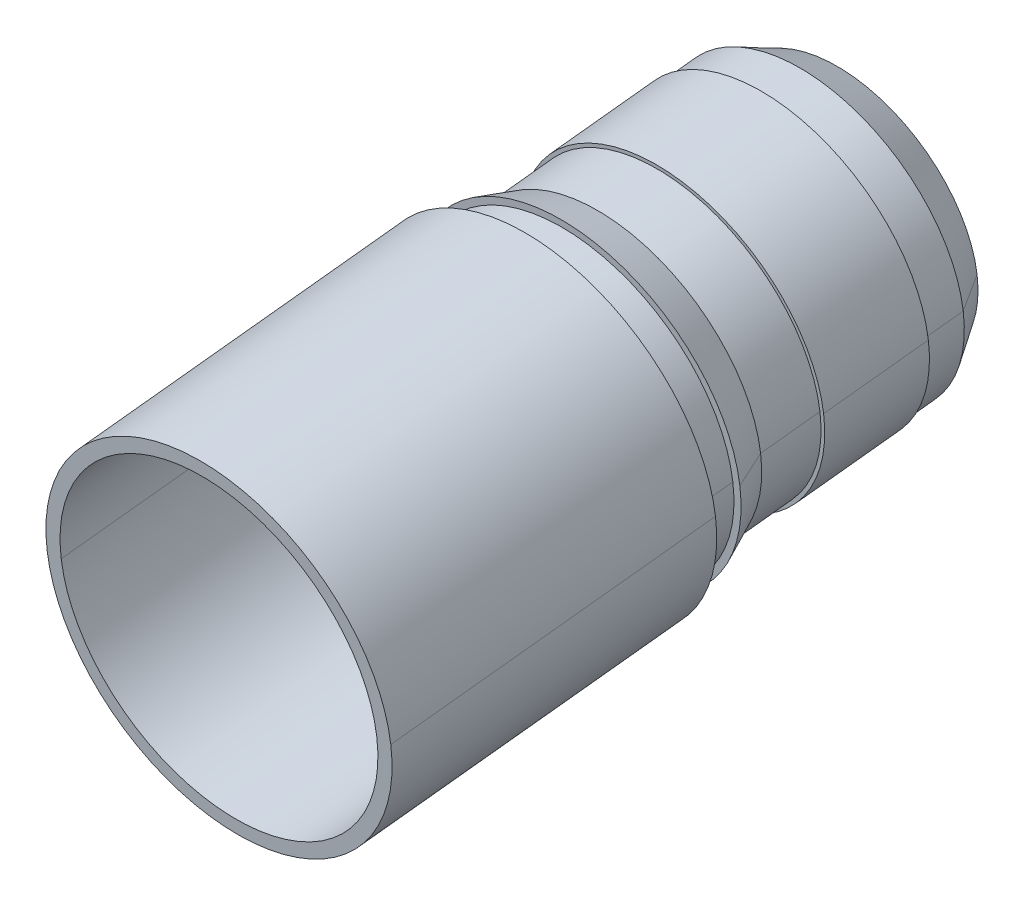
ISO-10303-21;
HEADER;
FILE_DESCRIPTION(('STEP AP214'),'2;1');
FILE_NAME('part.step','',(''),(''),'','','');
FILE_SCHEMA(('AUTOMOTIVE_DESIGN { 1 0 10303 214 1 1 1 1 }'));
ENDSEC;
DATA;
#1=APPLICATION_CONTEXT('core data for automotive mechanical design processes');
#2=APPLICATION_PROTOCOL_DEFINITION('international standard','automotive_design',2000,#1);
#3=PRODUCT_CONTEXT('',#1,'mechanical');
#4=PRODUCT('Part','Part','',(#3));
#5=PRODUCT_RELATED_PRODUCT_CATEGORY('part','',(#4));
#6=PRODUCT_DEFINITION_FORMATION('','',#4);
#7=PRODUCT_DEFINITION_CONTEXT('part definition',#1,'design');
#8=PRODUCT_DEFINITION('design','',#6,#7);
#9=PRODUCT_DEFINITION_SHAPE('','',#8);
#10=(LENGTH_UNIT() NAMED_UNIT(*) SI_UNIT(.MILLI.,.METRE.));
#11=(NAMED_UNIT(*) PLANE_ANGLE_UNIT() SI_UNIT($,.RADIAN.));
#12=(NAMED_UNIT(*) SI_UNIT($,.STERADIAN.) SOLID_ANGLE_UNIT());
#13=UNCERTAINTY_MEASURE_WITH_UNIT(LENGTH_MEASURE(1.E-05),#10,'distance_accuracy_value','');
#14=(GEOMETRIC_REPRESENTATION_CONTEXT(3) GLOBAL_UNCERTAINTY_ASSIGNED_CONTEXT((#13)) GLOBAL_UNIT_ASSIGNED_CONTEXT((#10,
#11,#12)) REPRESENTATION_CONTEXT('',''));
#15=CARTESIAN_POINT('',(0.,0.,0.));
#16=DIRECTION('',(0.,0.,1.));
#17=DIRECTION('',(1.,0.,0.));
#18=AXIS2_PLACEMENT_3D('',#15,#16,#17);
#19=CARTESIAN_POINT('',(14.5150151432412,132.941967215606,-6.97974796869001));
#20=DIRECTION('',(0.,-0.10808816258182,0.994141312444909));
#21=DIRECTION('',(-0.999908693388716,-0.0134339682706832,-0.0014606102053832));
#22=AXIS2_PLACEMENT_3D('',#19,#20,#21);
#23=CONICAL_SURFACE('',#22,5.78569961957873,0.541052068118243);
#24=CARTESIAN_POINT('',(14.5150151432412,133.137501170985,-8.77817231400749));
#25=DIRECTION('',(0.,0.10808816258182,-0.994141312444909));
#26=DIRECTION('',(-0.999908693388716,-0.0134339682706826,-0.00146061020538331));
#27=AXIS2_PLACEMENT_3D('',#24,#25,#26);
#28=CIRCLE('',#27,4.69872903312946);
#29=CARTESIAN_POINT('',(9.81671513513707,133.074378594241,-8.78503532558561));
#30=VERTEX_POINT('',#29);
#31=CARTESIAN_POINT('',(19.2133151513452,133.200623747729,-8.77130930242936));
#32=VERTEX_POINT('',#31);
#33=EDGE_CURVE('E13',#30,#32,#28,.T.);
#34=ORIENTED_EDGE('',*,*,#33,.T.);
#35=DIRECTION('',(0.514991048528762,-0.0857306334015749,0.852897695173232));
#36=VECTOR('',#35,1.);
#37=CARTESIAN_POINT('',(20.3001864901938,133.019692120719,-6.97129731678037));
#38=LINE('',#37,#36);
#39=CARTESIAN_POINT('',(20.2144946955569,133.033957246011,-7.11321499544652));
#40=VERTEX_POINT('',#39);
#41=EDGE_CURVE('E36',#32,#40,#38,.T.);
#42=ORIENTED_EDGE('',*,*,#41,.T.);
#43=CARTESIAN_POINT('',(14.5150151432412,132.957383626868,-7.12154047361721));
#44=DIRECTION('',(0.,0.10808816258182,-0.994141312444909));
#45=DIRECTION('',(0.999908693388717,0.0134339682706793,0.00146061020538294));
#46=AXIS2_PLACEMENT_3D('',#43,#44,#45);
#47=CIRCLE('',#46,5.7);
#48=CARTESIAN_POINT('',(8.8155355909255,132.880810007726,-7.1298659517879));
#49=VERTEX_POINT('',#48);
#50=EDGE_CURVE('E287',#49,#40,#47,.T.);
#51=ORIENTED_EDGE('',*,*,#50,.F.);
#52=DIRECTION('',(-0.514991048528744,-0.0995686437146445,0.851393155436483));
#53=VECTOR('',#52,1.);
#54=CARTESIAN_POINT('',(8.72984379628862,132.864242310493,-6.98819862059964));
#55=LINE('',#54,#53);
#56=EDGE_CURVE('E395',#30,#49,#55,.T.);
#57=ORIENTED_EDGE('',*,*,#56,.F.);
#58=EDGE_LOOP('',(#34,#42,#51,#57));
#59=FACE_BOUND('',#58,.T.);
#60=ADVANCED_FACE('F25',(#59),#23,.F.);
#61=CARTESIAN_POINT('',(14.5150151432412,132.975368927112,-7.28696034534012));
#62=DIRECTION('',(0.,-0.10808816258182,0.994141312444909));
#63=DIRECTION('',(0.999908693388716,0.0134339682706842,0.00146061020538324));
#64=AXIS2_PLACEMENT_3D('',#61,#62,#63);
#65=CYLINDRICAL_SURFACE('',#64,5.7);
#66=CARTESIAN_POINT('',(14.5150151432412,132.957383626868,-7.12154047361721));
#67=DIRECTION('',(0.,0.10808816258182,-0.994141312444909));
#68=DIRECTION('',(0.999908693388717,0.0134339682706793,0.00146061020538294));
#69=AXIS2_PLACEMENT_3D('',#66,#67,#68);
#70=CIRCLE('',#69,5.7);
#71=EDGE_CURVE('E372',#40,#49,#70,.T.);
#72=ORIENTED_EDGE('',*,*,#71,.T.);
#73=DIRECTION('',(0.,-0.10808816258182,0.994141312444909));
#74=VECTOR('',#73,1.);
#75=CARTESIAN_POINT('',(8.8155355909255,132.898795307969,-7.2952858235108));
#76=LINE('',#75,#74);
#77=CARTESIAN_POINT('',(8.81553559092552,132.65559694216,-5.05846787050975));
#78=VERTEX_POINT('',#77);
#79=EDGE_CURVE('E389',#49,#78,#76,.T.);
#80=ORIENTED_EDGE('',*,*,#79,.T.);
#81=CARTESIAN_POINT('',(14.5150151432412,132.732170561303,-5.05014239233907));
#82=DIRECTION('',(0.,0.10808816258182,-0.994141312444909));
#83=DIRECTION('',(-0.999908693388716,-0.0134339682706842,-0.00146061020538324));
#84=AXIS2_PLACEMENT_3D('',#81,#82,#83);
#85=CIRCLE('',#84,5.7);
#86=CARTESIAN_POINT('',(20.2144946955569,132.808744180446,-5.04181691416838));
#87=VERTEX_POINT('',#86);
#88=EDGE_CURVE('E353',#87,#78,#85,.T.);
#89=ORIENTED_EDGE('',*,*,#88,.F.);
#90=DIRECTION('',(0.,-0.10808816258182,0.994141312444909));
#91=VECTOR('',#90,1.);
#92=CARTESIAN_POINT('',(20.2144946955569,133.051942546255,-7.27863486716943));
#93=LINE('',#92,#91);
#94=EDGE_CURVE('E284',#40,#87,#93,.T.);
#95=ORIENTED_EDGE('',*,*,#94,.F.);
#96=EDGE_LOOP('',(#72,#80,#89,#95));
#97=FACE_BOUND('',#96,.T.);
#98=ADVANCED_FACE('F693',(#97),#65,.F.);
#99=CARTESIAN_POINT('',(14.5150151432412,132.797023458852,-5.64662717980602));
#100=DIRECTION('',(0.,-0.10808816258182,0.994141312444909));
#101=DIRECTION('',(0.999908693388716,0.0134339682706816,0.00146061020538321));
#102=AXIS2_PLACEMENT_3D('',#99,#100,#101);
#103=CYLINDRICAL_SURFACE('',#102,5.85);
#104=CARTESIAN_POINT('',(14.5150151432412,132.732170561303,-5.05014239233907));
#105=DIRECTION('',(0.,0.10808816258182,-0.994141312444909));
#106=DIRECTION('',(-0.999908693388716,-0.0134339682706816,-0.00146061020538321));
#107=AXIS2_PLACEMENT_3D('',#104,#105,#106);
#108=CIRCLE('',#107,5.85);
#109=CARTESIAN_POINT('',(20.3644809995652,132.810759275687,-5.04159782263758));
#110=VERTEX_POINT('',#109);
#111=CARTESIAN_POINT('',(8.66554928691722,132.65358184692,-5.05868696204056));
#112=VERTEX_POINT('',#111);
#113=EDGE_CURVE('E385',#110,#112,#108,.T.);
#114=ORIENTED_EDGE('',*,*,#113,.T.);
#115=DIRECTION('',(0.,-0.10808816258182,0.994141312444909));
#116=VECTOR('',#115,1.);
#117=CARTESIAN_POINT('',(8.66554928691721,132.718434744469,-5.65517174950751));
#118=LINE('',#117,#116);
#119=CARTESIAN_POINT('',(8.66554928691726,132.2968909104,-1.77802063097235));
#120=VERTEX_POINT('',#119);
#121=EDGE_CURVE('E390',#112,#120,#118,.T.);
#122=ORIENTED_EDGE('',*,*,#121,.T.);
#123=CARTESIAN_POINT('',(14.5150151432412,132.375479624783,-1.76947606127086));
#124=DIRECTION('',(0.,0.10808816258182,-0.994141312444909));
#125=DIRECTION('',(-0.999908693388716,-0.0134339682706816,-0.00146061020538321));
#126=AXIS2_PLACEMENT_3D('',#123,#124,#125);
#127=CIRCLE('',#126,5.85);
#128=CARTESIAN_POINT('',(20.3644809995653,132.454068339167,-1.76093149156938));
#129=VERTEX_POINT('',#128);
#130=EDGE_CURVE('E426',#129,#120,#127,.T.);
#131=ORIENTED_EDGE('',*,*,#130,.F.);
#132=DIRECTION('',(0.,-0.10808816258182,0.994141312444909));
#133=VECTOR('',#132,1.);
#134=CARTESIAN_POINT('',(20.3644809995652,132.875612173236,-5.63808261010453));
#135=LINE('',#134,#133);
#136=EDGE_CURVE('E357',#110,#129,#135,.T.);
#137=ORIENTED_EDGE('',*,*,#136,.F.);
#138=EDGE_LOOP('',(#114,#122,#131,#137));
#139=FACE_BOUND('',#138,.T.);
#140=ADVANCED_FACE('F699',(#139),#103,.F.);
#141=CARTESIAN_POINT('',(14.5150151432412,132.310626727234,-1.17299127380392));
#142=DIRECTION('',(0.,-0.10808816258182,0.994141312444909));
#143=DIRECTION('',(0.999908693388716,0.0134339682706815,0.00146061020538318));
#144=AXIS2_PLACEMENT_3D('',#141,#142,#143);
#145=CYLINDRICAL_SURFACE('',#144,5.69396066124727);
#146=CARTESIAN_POINT('',(14.5150151432412,132.375479624783,-1.76947606127086));
#147=DIRECTION('',(0.,0.10808816258182,-0.994141312444909));
#148=DIRECTION('',(-0.999908693388716,-0.0134339682706815,-0.00146061020538318));
#149=AXIS2_PLACEMENT_3D('',#146,#147,#148);
#150=CIRCLE('',#149,5.69396066124727);
#151=CARTESIAN_POINT('',(20.2084559082357,132.451972111641,-1.76115940421999));
#152=VERTEX_POINT('',#151);
#153=CARTESIAN_POINT('',(8.82157437824673,132.298987137925,-1.77779271832174));
#154=VERTEX_POINT('',#153);
#155=EDGE_CURVE('E394',#152,#154,#150,.T.);
#156=ORIENTED_EDGE('',*,*,#155,.T.);
#157=DIRECTION('',(0.,-0.10808816258182,0.994141312444909));
#158=VECTOR('',#157,1.);
#159=CARTESIAN_POINT('',(8.82157437824674,132.234134240376,-1.18130793085479));
#160=LINE('',#159,#158);
#161=CARTESIAN_POINT('',(8.82157437824677,131.945903299519,1.46969731326351));
#162=VERTEX_POINT('',#161);
#163=EDGE_CURVE('E293',#154,#162,#160,.T.);
#164=ORIENTED_EDGE('',*,*,#163,.T.);
#165=CARTESIAN_POINT('',(14.5150151432413,132.022395786376,1.47801397031438));
#166=DIRECTION('',(0.,0.10808816258182,-0.994141312444909));
#167=DIRECTION('',(0.999908693388716,0.0134339682706815,0.00146061020538329));
#168=AXIS2_PLACEMENT_3D('',#165,#166,#167);
#169=CIRCLE('',#168,5.69396066124727);
#170=CARTESIAN_POINT('',(20.2084559082358,132.098888273234,1.48633062736525));
#171=VERTEX_POINT('',#170);
#172=EDGE_CURVE('E155',#171,#162,#169,.T.);
#173=ORIENTED_EDGE('',*,*,#172,.F.);
#174=DIRECTION('',(0.,-0.10808816258182,0.994141312444909));
#175=VECTOR('',#174,1.);
#176=CARTESIAN_POINT('',(20.2084559082357,132.387119214092,-1.16467461675305));
#177=LINE('',#176,#175);
#178=EDGE_CURVE('E143',#152,#171,#177,.T.);
#179=ORIENTED_EDGE('',*,*,#178,.F.);
#180=EDGE_LOOP('',(#156,#164,#173,#179));
#181=FACE_BOUND('',#180,.T.);
#182=ADVANCED_FACE('F722',(#181),#145,.F.);
#183=CARTESIAN_POINT('',(14.5150151432413,131.848575345754,3.07672817585537));
#184=DIRECTION('',(0.,-0.10808816258182,0.994141312444909));
#185=DIRECTION('',(-0.999908693388716,-0.0134339682706829,-0.00146061020538321));
#186=AXIS2_PLACEMENT_3D('',#183,#184,#185);
#187=CONICAL_SURFACE('',#186,6.34368968725993,0.383972435438753);
#188=CARTESIAN_POINT('',(14.5150151432413,132.022395786376,1.47801397031438));
#189=DIRECTION('',(0.,0.10808816258182,-0.994141312444909));
#190=DIRECTION('',(0.999908693388717,0.0134339682706766,0.00146061020538272));
#191=AXIS2_PLACEMENT_3D('',#188,#189,#190);
#192=CIRCLE('',#191,5.69396066124727);
#193=EDGE_CURVE('E289',#162,#171,#192,.T.);
#194=ORIENTED_EDGE('',*,*,#193,.T.);
#195=DIRECTION('',(0.374572389357313,-0.0951851461257159,0.922298928270103));
#196=VECTOR('',#195,1.);
#197=CARTESIAN_POINT('',(20.8581256096928,131.933796271731,3.08599383375237));
#198=LINE('',#197,#196);
#199=CARTESIAN_POINT('',(20.5249297670866,132.018466941188,2.26557519833973));
#200=VERTEX_POINT('',#199);
#201=EDGE_CURVE('E294',#171,#200,#198,.T.);
#202=ORIENTED_EDGE('',*,*,#201,.T.);
#203=CARTESIAN_POINT('',(14.5150151432413,131.937722566327,2.25679625413101));
#204=DIRECTION('',(0.,0.10808816258182,-0.994141312444909));
#205=DIRECTION('',(-0.999908693388716,-0.0134339682706823,-0.00146061020538319));
#206=AXIS2_PLACEMENT_3D('',#203,#204,#205);
#207=CIRCLE('',#206,6.01046341889236);
#208=CARTESIAN_POINT('',(8.50510051939595,131.856978191465,2.2480173099223));
#209=VERTEX_POINT('',#208);
#210=EDGE_CURVE('E333',#209,#200,#207,.T.);
#211=ORIENTED_EDGE('',*,*,#210,.F.);
#212=DIRECTION('',(-0.374572389357293,-0.105250052305591,0.921204619843408));
#213=VECTOR('',#212,1.);
#214=CARTESIAN_POINT('',(8.17190467678974,131.763354419776,3.06746251795837));
#215=LINE('',#214,#213);
#216=EDGE_CURVE('E337',#162,#209,#215,.T.);
#217=ORIENTED_EDGE('',*,*,#216,.F.);
#218=EDGE_LOOP('',(#194,#202,#211,#217));
#219=FACE_BOUND('',#218,.T.);
#220=ADVANCED_FACE('F718',(#219),#187,.F.);
#221=CARTESIAN_POINT('',(14.5150151432413,131.872869668778,2.85328104159796));
#222=DIRECTION('',(0.,-0.10808816258182,0.994141312444909));
#223=DIRECTION('',(0.999908693388716,0.0134339682706837,0.00146061020538319));
#224=AXIS2_PLACEMENT_3D('',#221,#222,#223);
#225=CYLINDRICAL_SURFACE('',#224,6.);
#226=CARTESIAN_POINT('',(14.5150151432413,131.937722566327,2.25679625413101));
#227=DIRECTION('',(0.,0.10808816258182,-0.994141312444909));
#228=DIRECTION('',(-0.999908693388716,-0.0134339682706837,-0.00146061020538319));
#229=AXIS2_PLACEMENT_3D('',#226,#227,#228);
#230=CIRCLE('',#229,6.);
#231=CARTESIAN_POINT('',(20.5144673035736,132.018326375951,2.26555991536332));
#232=VERTEX_POINT('',#231);
#233=CARTESIAN_POINT('',(8.51556298290898,131.857118756703,2.24803259289871));
#234=VERTEX_POINT('',#233);
#235=EDGE_CURVE('E332',#232,#234,#230,.T.);
#236=ORIENTED_EDGE('',*,*,#235,.T.);
#237=DIRECTION('',(0.,-0.10808816258182,0.994141312444909));
#238=VECTOR('',#237,1.);
#239=CARTESIAN_POINT('',(8.51556298290899,131.792265859154,2.84451738036566));
#240=LINE('',#239,#238);
#241=CARTESIAN_POINT('',(8.51556298290901,131.565280717732,4.93221413649998));
#242=VERTEX_POINT('',#241);
#243=EDGE_CURVE('E348',#234,#242,#240,.T.);
#244=ORIENTED_EDGE('',*,*,#243,.T.);
#245=CARTESIAN_POINT('',(14.5150151432413,131.645884527356,4.94097779773228));
#246=DIRECTION('',(0.,0.10808816258182,-0.994141312444909));
#247=DIRECTION('',(-0.999908693388716,-0.0134339682706837,-0.00146061020538319));
#248=AXIS2_PLACEMENT_3D('',#245,#246,#247);
#249=CIRCLE('',#248,6.);
#250=CARTESIAN_POINT('',(20.5144673035736,131.72648833698,4.94974145896458));
#251=VERTEX_POINT('',#250);
#252=EDGE_CURVE('E305',#251,#242,#249,.T.);
#253=ORIENTED_EDGE('',*,*,#252,.F.);
#254=DIRECTION('',(0.,-0.10808816258182,0.994141312444909));
#255=VECTOR('',#254,1.);
#256=CARTESIAN_POINT('',(20.5144673035736,131.953473478402,2.86204470283026));
#257=LINE('',#256,#255);
#258=EDGE_CURVE('E361',#232,#251,#257,.T.);
#259=ORIENTED_EDGE('',*,*,#258,.F.);
#260=EDGE_LOOP('',(#236,#244,#253,#259));
#261=FACE_BOUND('',#260,.T.);
#262=ADVANCED_FACE('F721',(#261),#225,.F.);
#263=CARTESIAN_POINT('',(14.5150151432413,131.710737424905,4.34449301026533));
#264=DIRECTION('',(0.,-0.10808816258182,0.994141312444909));
#265=DIRECTION('',(0.999908693388717,0.0134339682706807,0.0014606102053832));
#266=AXIS2_PLACEMENT_3D('',#263,#264,#265);
#267=CYLINDRICAL_SURFACE('',#266,6.75);
#268=CARTESIAN_POINT('',(14.5150151432413,131.645884527356,4.94097779773228));
#269=DIRECTION('',(0.,0.10808816258182,-0.994141312444909));
#270=DIRECTION('',(-0.999908693388717,-0.0134339682706807,-0.0014606102053832));
#271=AXIS2_PLACEMENT_3D('',#268,#269,#270);
#272=CIRCLE('',#271,6.75);
#273=CARTESIAN_POINT('',(21.2643988236151,131.736563813183,4.95083691661861));
#274=VERTEX_POINT('',#273);
#275=CARTESIAN_POINT('',(7.76563146286748,131.555205241529,4.93111867884594));
#276=VERTEX_POINT('',#275);
#277=EDGE_CURVE('E270',#274,#276,#272,.T.);
#278=ORIENTED_EDGE('',*,*,#277,.T.);
#279=DIRECTION('',(0.,-0.10808816258182,0.994141312444909));
#280=VECTOR('',#279,1.);
#281=CARTESIAN_POINT('',(7.76563146286747,131.620058139078,4.33463389137899));
#282=LINE('',#281,#280);
#283=CARTESIAN_POINT('',(7.76563146286762,130.112228271061,18.2029051999855));
#284=VERTEX_POINT('',#283);
#285=EDGE_CURVE('E193',#276,#284,#282,.T.);
#286=ORIENTED_EDGE('',*,*,#285,.T.);
#287=CARTESIAN_POINT('',(14.5150151432414,130.202907556889,18.2127643188718));
#288=DIRECTION('',(0.,0.10808816258182,-0.994141312444909));
#289=DIRECTION('',(-0.999908693388717,-0.0134339682706806,-0.00146061020538307));
#290=AXIS2_PLACEMENT_3D('',#287,#288,#289);
#291=CIRCLE('',#290,6.75);
#292=CARTESIAN_POINT('',(21.2643988236153,130.293586842716,18.2226234377581));
#293=VERTEX_POINT('',#292);
#294=EDGE_CURVE('E205',#293,#284,#291,.T.);
#295=ORIENTED_EDGE('',*,*,#294,.F.);
#296=DIRECTION('',(0.,-0.10808816258182,0.994141312444909));
#297=VECTOR('',#296,1.);
#298=CARTESIAN_POINT('',(21.2643988236151,131.801416710732,4.35435212915167));
#299=LINE('',#298,#297);
#300=EDGE_CURVE('E320',#274,#293,#299,.T.);
#301=ORIENTED_EDGE('',*,*,#300,.F.);
#302=EDGE_LOOP('',(#278,#286,#295,#301));
#303=FACE_BOUND('',#302,.T.);
#304=ADVANCED_FACE('F703',(#303),#267,.F.);
#305=CARTESIAN_POINT('',(14.5150151432412,132.975368927112,-7.28696034534012));
#306=DIRECTION('',(0.,-0.10808816258182,0.994141312444909));
#307=DIRECTION('',(-0.999908693388716,-0.0134339682706833,-0.00146061020538314));
#308=AXIS2_PLACEMENT_3D('',#305,#306,#307);
#309=CONICAL_SURFACE('',#308,6.3,0.541052068118243);
#310=CARTESIAN_POINT('',(14.5150151432412,133.137501170985,-8.77817231400749));
#311=DIRECTION('',(0.,0.10808816258182,-0.994141312444909));
#312=DIRECTION('',(-0.999908693388716,-0.013433968270683,-0.00146061020538313));
#313=AXIS2_PLACEMENT_3D('',#310,#311,#312);
#314=CIRCLE('',#313,5.39870907145866);
#315=CARTESIAN_POINT('',(19.9132312768692,133.210027257354,-8.77028690444182));
#316=VERTEX_POINT('',#315);
#317=CARTESIAN_POINT('',(9.11679900961314,133.064975084616,-8.78605772357315));
#318=VERTEX_POINT('',#317);
#319=EDGE_CURVE('E419',#316,#318,#314,.T.);
#320=ORIENTED_EDGE('',*,*,#319,.F.);
#321=DIRECTION('',(0.514991048528762,-0.0857306334015749,0.852897695173232));
#322=VECTOR('',#321,1.);
#323=CARTESIAN_POINT('',(20.8144399115901,133.060002927218,-7.2777585010462));
#324=LINE('',#323,#322);
#325=CARTESIAN_POINT('',(20.8144399115901,133.060002927218,-7.2777585010462));
#326=VERTEX_POINT('',#325);
#327=EDGE_CURVE('E307',#316,#326,#324,.T.);
#328=ORIENTED_EDGE('',*,*,#327,.T.);
#329=CARTESIAN_POINT('',(14.5150151432412,132.975368927112,-7.28696034534012));
#330=DIRECTION('',(0.,0.10808816258182,-0.994141312444909));
#331=DIRECTION('',(-0.999908693388716,-0.0134339682706833,-0.00146061020538314));
#332=AXIS2_PLACEMENT_3D('',#329,#330,#331);
#333=CIRCLE('',#332,6.3);
#334=CARTESIAN_POINT('',(8.21559037489227,132.890734927007,-7.29616218963403));
#335=VERTEX_POINT('',#334);
#336=EDGE_CURVE('E311',#326,#335,#333,.T.);
#337=ORIENTED_EDGE('',*,*,#336,.T.);
#338=DIRECTION('',(-0.514991048528744,-0.0995686437146445,0.851393155436483));
#339=VECTOR('',#338,1.);
#340=CARTESIAN_POINT('',(8.21559037489227,132.890734927007,-7.29616218963403));
#341=LINE('',#340,#339);
#342=EDGE_CURVE('E398',#318,#335,#341,.T.);
#343=ORIENTED_EDGE('',*,*,#342,.F.);
#344=EDGE_LOOP('',(#320,#328,#337,#343));
#345=FACE_BOUND('',#344,.T.);
#346=ADVANCED_FACE('F550',(#345),#309,.T.);
#347=CARTESIAN_POINT('',(14.5150151432412,132.975368927112,-7.28696034534012));
#348=DIRECTION('',(0.,-0.10808816258182,0.994141312444909));
#349=DIRECTION('',(0.999908693388716,0.0134339682706833,0.00146061020538314));
#350=AXIS2_PLACEMENT_3D('',#347,#348,#349);
#351=CYLINDRICAL_SURFACE('',#350,6.3);
#352=CARTESIAN_POINT('',(14.5150151432412,132.975368927112,-7.28696034534012));
#353=DIRECTION('',(0.,0.10808816258182,-0.994141312444909));
#354=DIRECTION('',(-0.999908693388716,-0.0134339682706833,-0.00146061020538314));
#355=AXIS2_PLACEMENT_3D('',#352,#353,#354);
#356=CIRCLE('',#355,6.3);
#357=EDGE_CURVE('E401',#335,#326,#356,.T.);
#358=ORIENTED_EDGE('',*,*,#357,.F.);
#359=DIRECTION('',(0.,-0.10808816258182,0.994141312444909));
#360=VECTOR('',#359,1.);
#361=CARTESIAN_POINT('',(8.21559037489227,132.890734927007,-7.29616218963403));
#362=LINE('',#361,#360);
#363=CARTESIAN_POINT('',(8.21559037489229,132.712389458747,-5.65582902409993));
#364=VERTEX_POINT('',#363);
#365=EDGE_CURVE('E343',#335,#364,#362,.T.);
#366=ORIENTED_EDGE('',*,*,#365,.T.);
#367=CARTESIAN_POINT('',(14.5150151432412,132.797023458852,-5.64662717980602));
#368=DIRECTION('',(0.,0.10808816258182,-0.994141312444909));
#369=DIRECTION('',(-0.999908693388716,-0.0134339682706833,-0.00146061020538314));
#370=AXIS2_PLACEMENT_3D('',#367,#368,#369);
#371=CIRCLE('',#370,6.3);
#372=CARTESIAN_POINT('',(20.8144399115901,132.881657458958,-5.6374253355121));
#373=VERTEX_POINT('',#372);
#374=EDGE_CURVE('E339',#364,#373,#371,.T.);
#375=ORIENTED_EDGE('',*,*,#374,.T.);
#376=DIRECTION('',(0.,-0.10808816258182,0.994141312444909));
#377=VECTOR('',#376,1.);
#378=CARTESIAN_POINT('',(20.8144399115901,133.060002927218,-7.2777585010462));
#379=LINE('',#378,#377);
#380=EDGE_CURVE('E241',#326,#373,#379,.T.);
#381=ORIENTED_EDGE('',*,*,#380,.F.);
#382=EDGE_LOOP('',(#358,#366,#375,#381));
#383=FACE_BOUND('',#382,.T.);
#384=ADVANCED_FACE('F543',(#383),#351,.T.);
#385=CARTESIAN_POINT('',(14.5150151432412,132.797023458852,-5.64662717980602));
#386=DIRECTION('',(0.,-0.10808816258182,0.994141312444909));
#387=DIRECTION('',(0.999908693388717,0.0134339682706809,0.00146061020538325));
#388=AXIS2_PLACEMENT_3D('',#385,#386,#387);
#389=CYLINDRICAL_SURFACE('',#388,6.45);
#390=CARTESIAN_POINT('',(14.5150151432412,132.797023458852,-5.64662717980602));
#391=DIRECTION('',(0.,0.10808816258182,-0.994141312444909));
#392=DIRECTION('',(-0.999908693388717,-0.0134339682706809,-0.00146061020538325));
#393=AXIS2_PLACEMENT_3D('',#390,#391,#392);
#394=CIRCLE('',#393,6.45);
#395=CARTESIAN_POINT('',(8.06560407088398,132.710374363506,-5.65604811563074));
#396=VERTEX_POINT('',#395);
#397=CARTESIAN_POINT('',(20.9644262155984,132.883672554198,-5.6372062439813));
#398=VERTEX_POINT('',#397);
#399=EDGE_CURVE('E258',#396,#398,#394,.T.);
#400=ORIENTED_EDGE('',*,*,#399,.F.);
#401=DIRECTION('',(0.,-0.10808816258182,0.994141312444909));
#402=VECTOR('',#401,1.);
#403=CARTESIAN_POINT('',(8.06560407088398,132.710374363506,-5.65604811563074));
#404=LINE('',#403,#402);
#405=CARTESIAN_POINT('',(8.06560407088403,132.223977631888,-1.18241220962864));
#406=VERTEX_POINT('',#405);
#407=EDGE_CURVE('E344',#396,#406,#404,.T.);
#408=ORIENTED_EDGE('',*,*,#407,.T.);
#409=CARTESIAN_POINT('',(14.5150151432412,132.310626727234,-1.17299127380392));
#410=DIRECTION('',(0.,0.10808816258182,-0.994141312444909));
#411=DIRECTION('',(-0.999908693388717,-0.0134339682706809,-0.00146061020538318));
#412=AXIS2_PLACEMENT_3D('',#409,#410,#411);
#413=CIRCLE('',#412,6.45);
#414=CARTESIAN_POINT('',(20.9644262155985,132.39727582258,-1.1635703379792));
#415=VERTEX_POINT('',#414);
#416=EDGE_CURVE('E352',#406,#415,#413,.T.);
#417=ORIENTED_EDGE('',*,*,#416,.T.);
#418=DIRECTION('',(0.,-0.10808816258182,0.994141312444909));
#419=VECTOR('',#418,1.);
#420=CARTESIAN_POINT('',(20.9644262155984,132.883672554198,-5.6372062439813));
#421=LINE('',#420,#419);
#422=EDGE_CURVE('E312',#398,#415,#421,.T.);
#423=ORIENTED_EDGE('',*,*,#422,.F.);
#424=EDGE_LOOP('',(#400,#408,#417,#423));
#425=FACE_BOUND('',#424,.T.);
#426=ADVANCED_FACE('F446',(#425),#389,.T.);
#427=CARTESIAN_POINT('',(14.5150151432412,132.310626727234,-1.17299127380392));
#428=DIRECTION('',(0.,-0.10808816258182,0.994141312444909));
#429=DIRECTION('',(0.999908693388717,0.0134339682706808,0.00146061020538319));
#430=AXIS2_PLACEMENT_3D('',#427,#428,#429);
#431=CYLINDRICAL_SURFACE('',#430,6.29396066124727);
#432=CARTESIAN_POINT('',(14.5150151432412,132.310626727234,-1.17299127380392));
#433=DIRECTION('',(0.,0.10808816258182,-0.994141312444909));
#434=DIRECTION('',(-0.999908693388717,-0.0134339682706808,-0.00146061020538319));
#435=AXIS2_PLACEMENT_3D('',#432,#433,#434);
#436=CIRCLE('',#435,6.29396066124727);
#437=CARTESIAN_POINT('',(8.22162916221351,132.226073859414,-1.18218429697802));
#438=VERTEX_POINT('',#437);
#439=CARTESIAN_POINT('',(20.808401124269,132.395179595054,-1.16379825062982));
#440=VERTEX_POINT('',#439);
#441=EDGE_CURVE('E232',#438,#440,#436,.T.);
#442=ORIENTED_EDGE('',*,*,#441,.F.);
#443=DIRECTION('',(0.,-0.10808816258182,0.994141312444909));
#444=VECTOR('',#443,1.);
#445=CARTESIAN_POINT('',(8.22162916221351,132.226073859414,-1.18218429697802));
#446=LINE('',#445,#444);
#447=CARTESIAN_POINT('',(8.22162916221354,131.95044904483,1.3528760497565));
#448=VERTEX_POINT('',#447);
#449=EDGE_CURVE('E256',#438,#448,#446,.T.);
#450=ORIENTED_EDGE('',*,*,#449,.T.);
#451=CARTESIAN_POINT('',(14.5150151432413,132.03500191265,1.3620690729306));
#452=DIRECTION('',(0.,0.10808816258182,-0.994141312444909));
#453=DIRECTION('',(-0.999908693388717,-0.0134339682706808,-0.00146061020538319));
#454=AXIS2_PLACEMENT_3D('',#451,#452,#453);
#455=CIRCLE('',#454,6.29396066124726);
#456=CARTESIAN_POINT('',(20.808401124269,132.11955478047,1.3712620961047));
#457=VERTEX_POINT('',#456);
#458=EDGE_CURVE('E248',#448,#457,#455,.T.);
#459=ORIENTED_EDGE('',*,*,#458,.T.);
#460=DIRECTION('',(0.,-0.10808816258182,0.994141312444909));
#461=VECTOR('',#460,1.);
#462=CARTESIAN_POINT('',(20.808401124269,132.395179595054,-1.16379825062982));
#463=LINE('',#462,#461);
#464=EDGE_CURVE('E245',#440,#457,#463,.T.);
#465=ORIENTED_EDGE('',*,*,#464,.F.);
#466=EDGE_LOOP('',(#442,#450,#459,#465));
#467=FACE_BOUND('',#466,.T.);
#468=ADVANCED_FACE('F246',(#467),#431,.T.);
#469=CARTESIAN_POINT('',(14.5150151432413,131.872869668778,2.85328104159796));
#470=DIRECTION('',(0.,-0.10808816258182,0.994141312444909));
#471=DIRECTION('',(-0.999908693388716,-0.0134339682706825,-0.00146061020538318));
#472=AXIS2_PLACEMENT_3D('',#469,#470,#471);
#473=CONICAL_SURFACE('',#472,6.9,0.383972435438753);
#474=CARTESIAN_POINT('',(14.5150151432413,132.03500191265,1.3620690729306));
#475=DIRECTION('',(0.,0.10808816258182,-0.994141312444909));
#476=DIRECTION('',(-0.999908693388717,-0.0134339682706808,-0.00146061020538319));
#477=AXIS2_PLACEMENT_3D('',#474,#475,#476);
#478=CIRCLE('',#477,6.29396066124726);
#479=EDGE_CURVE('E253',#457,#448,#478,.T.);
#480=ORIENTED_EDGE('',*,*,#479,.F.);
#481=DIRECTION('',(0.374572389357313,-0.0951851461257159,0.922298928270103));
#482=VECTOR('',#481,1.);
#483=CARTESIAN_POINT('',(21.4143851276235,131.965564049845,2.86335925201511));
#484=LINE('',#483,#482);
#485=CARTESIAN_POINT('',(21.4143851276235,131.965564049845,2.86335925201511));
#486=VERTEX_POINT('',#485);
#487=EDGE_CURVE('E436',#457,#486,#484,.T.);
#488=ORIENTED_EDGE('',*,*,#487,.T.);
#489=CARTESIAN_POINT('',(14.5150151432413,131.872869668778,2.85328104159796));
#490=DIRECTION('',(0.,0.10808816258182,-0.994141312444909));
#491=DIRECTION('',(-0.999908693388716,-0.0134339682706825,-0.00146061020538318));
#492=AXIS2_PLACEMENT_3D('',#489,#490,#491);
#493=CIRCLE('',#492,6.9);
#494=CARTESIAN_POINT('',(7.61564515885915,131.78017528771,2.84320283118082));
#495=VERTEX_POINT('',#494);
#496=EDGE_CURVE('E433',#486,#495,#493,.T.);
#497=ORIENTED_EDGE('',*,*,#496,.T.);
#498=DIRECTION('',(-0.374572389357293,-0.105250052305591,0.921204619843408));
#499=VECTOR('',#498,1.);
#500=CARTESIAN_POINT('',(7.61564515885915,131.78017528771,2.84320283118082));
#501=LINE('',#500,#499);
#502=EDGE_CURVE('E275',#448,#495,#501,.T.);
#503=ORIENTED_EDGE('',*,*,#502,.F.);
#504=EDGE_LOOP('',(#480,#488,#497,#503));
#505=FACE_BOUND('',#504,.T.);
#506=ADVANCED_FACE('F707',(#505),#473,.T.);
#507=CARTESIAN_POINT('',(14.5150151432413,131.872869668778,2.85328104159796));
#508=DIRECTION('',(0.,-0.10808816258182,0.994141312444909));
#509=DIRECTION('',(0.999908693388716,0.0134339682706829,0.00146061020538323));
#510=AXIS2_PLACEMENT_3D('',#507,#508,#509);
#511=CYLINDRICAL_SURFACE('',#510,6.6);
#512=CARTESIAN_POINT('',(14.5150151432413,131.872869668778,2.85328104159796));
#513=DIRECTION('',(0.,0.10808816258182,-0.994141312444909));
#514=DIRECTION('',(-0.999908693388716,-0.0134339682706829,-0.00146061020538323));
#515=AXIS2_PLACEMENT_3D('',#512,#513,#514);
#516=CIRCLE('',#515,6.6);
#517=CARTESIAN_POINT('',(7.91561776687576,131.784205478191,2.84364101424243));
#518=VERTEX_POINT('',#517);
#519=CARTESIAN_POINT('',(21.1144125196068,131.961533859364,2.86292106895349));
#520=VERTEX_POINT('',#519);
#521=EDGE_CURVE('E252',#518,#520,#516,.T.);
#522=ORIENTED_EDGE('',*,*,#521,.F.);
#523=DIRECTION('',(0.,-0.10808816258182,0.994141312444909));
#524=VECTOR('',#523,1.);
#525=CARTESIAN_POINT('',(7.91561776687576,131.784205478191,2.84364101424244));
#526=LINE('',#525,#524);
#527=CARTESIAN_POINT('',(7.91561776687578,131.622073234318,4.3348529829098));
#528=VERTEX_POINT('',#527);
#529=EDGE_CURVE('E411',#518,#528,#526,.T.);
#530=ORIENTED_EDGE('',*,*,#529,.T.);
#531=CARTESIAN_POINT('',(14.5150151432413,131.710737424905,4.34449301026533));
#532=DIRECTION('',(0.,0.10808816258182,-0.994141312444909));
#533=DIRECTION('',(-0.999908693388716,-0.0134339682706829,-0.00146061020538323));
#534=AXIS2_PLACEMENT_3D('',#531,#532,#533);
#535=CIRCLE('',#534,6.6);
#536=CARTESIAN_POINT('',(21.1144125196068,131.799401615491,4.35413303762087));
#537=VERTEX_POINT('',#536);
#538=EDGE_CURVE('E407',#528,#537,#535,.T.);
#539=ORIENTED_EDGE('',*,*,#538,.T.);
#540=DIRECTION('',(0.,-0.10808816258182,0.994141312444909));
#541=VECTOR('',#540,1.);
#542=CARTESIAN_POINT('',(21.1144125196068,131.961533859364,2.86292106895349));
#543=LINE('',#542,#541);
#544=EDGE_CURVE('E274',#520,#537,#543,.T.);
#545=ORIENTED_EDGE('',*,*,#544,.F.);
#546=EDGE_LOOP('',(#522,#530,#539,#545));
#547=FACE_BOUND('',#546,.T.);
#548=ADVANCED_FACE('F1005',(#547),#511,.T.);
#549=CARTESIAN_POINT('',(14.5150151432413,131.710737424905,4.34449301026533));
#550=DIRECTION('',(0.,-0.10808816258182,0.994141312444909));
#551=DIRECTION('',(0.999908693388717,0.0134339682706801,0.00146061020538324));
#552=AXIS2_PLACEMENT_3D('',#549,#550,#551);
#553=CYLINDRICAL_SURFACE('',#552,7.35);
#554=CARTESIAN_POINT('',(14.5150151432413,131.710737424905,4.34449301026533));
#555=DIRECTION('',(0.,0.10808816258182,-0.994141312444909));
#556=DIRECTION('',(-0.999908693388717,-0.0134339682706801,-0.00146061020538324));
#557=AXIS2_PLACEMENT_3D('',#554,#555,#556);
#558=CIRCLE('',#557,7.35);
#559=CARTESIAN_POINT('',(7.16568624683424,131.611997758115,4.33375752525576));
#560=VERTEX_POINT('',#559);
#561=CARTESIAN_POINT('',(21.8643440396484,131.809477091694,4.3552284952749));
#562=VERTEX_POINT('',#561);
#563=EDGE_CURVE('E366',#560,#562,#558,.T.);
#564=ORIENTED_EDGE('',*,*,#563,.F.);
#565=DIRECTION('',(0.,-0.10808816258182,0.994141312444909));
#566=VECTOR('',#565,1.);
#567=CARTESIAN_POINT('',(7.16568624683424,131.611997758115,4.33375752525576));
#568=LINE('',#567,#566);
#569=CARTESIAN_POINT('',(7.16568624683439,130.104167890099,18.2020288338623));
#570=VERTEX_POINT('',#569);
#571=EDGE_CURVE('E299',#560,#570,#568,.T.);
#572=ORIENTED_EDGE('',*,*,#571,.T.);
#573=CARTESIAN_POINT('',(14.5150151432414,130.202907556889,18.2127643188718));
#574=DIRECTION('',(0.,0.10808816258182,-0.994141312444909));
#575=DIRECTION('',(-0.999908693388717,-0.0134339682706801,-0.001460610205383));
#576=AXIS2_PLACEMENT_3D('',#573,#574,#575);
#577=CIRCLE('',#576,7.35);
#578=CARTESIAN_POINT('',(21.8643440396485,130.301647223678,18.2234998038813));
#579=VERTEX_POINT('',#578);
#580=EDGE_CURVE('E295',#570,#579,#577,.T.);
#581=ORIENTED_EDGE('',*,*,#580,.T.);
#582=DIRECTION('',(0.,-0.10808816258182,0.994141312444909));
#583=VECTOR('',#582,1.);
#584=CARTESIAN_POINT('',(21.8643440396484,131.809477091694,4.3552284952749));
#585=LINE('',#584,#583);
#586=EDGE_CURVE('E300',#562,#579,#585,.T.);
#587=ORIENTED_EDGE('',*,*,#586,.F.);
#588=EDGE_LOOP('',(#564,#572,#581,#587));
#589=FACE_BOUND('',#588,.T.);
#590=ADVANCED_FACE('F673',(#589),#553,.T.);
#591=CARTESIAN_POINT('',(14.5150151432413,131.710737424905,4.34449301026533));
#592=DIRECTION('',(0.,-0.10808816258182,0.994141312444909));
#593=DIRECTION('',(0.999908693388717,0.0134339682706801,0.00146061020538324));
#594=AXIS2_PLACEMENT_3D('',#591,#592,#593);
#595=CYLINDRICAL_SURFACE('',#594,7.35);
#596=ORIENTED_EDGE('',*,*,#571,.F.);
#597=CARTESIAN_POINT('',(14.5150151432413,131.710737424905,4.34449301026533));
#598=DIRECTION('',(0.,0.10808816258182,-0.994141312444909));
#599=DIRECTION('',(-0.999908693388717,-0.0134339682706801,-0.00146061020538324));
#600=AXIS2_PLACEMENT_3D('',#597,#598,#599);
#601=CIRCLE('',#600,7.35);
#602=EDGE_CURVE('E414',#562,#560,#601,.T.);
#603=ORIENTED_EDGE('',*,*,#602,.F.);
#604=ORIENTED_EDGE('',*,*,#586,.T.);
#605=CARTESIAN_POINT('',(14.5150151432414,130.202907556889,18.2127643188718));
#606=DIRECTION('',(0.,0.10808816258182,-0.994141312444909));
#607=DIRECTION('',(-0.999908693388717,-0.0134339682706801,-0.001460610205383));
#608=AXIS2_PLACEMENT_3D('',#605,#606,#607);
#609=CIRCLE('',#608,7.35);
#610=EDGE_CURVE('E325',#579,#570,#609,.T.);
#611=ORIENTED_EDGE('',*,*,#610,.T.);
#612=EDGE_LOOP('',(#596,#603,#604,#611));
#613=FACE_BOUND('',#612,.T.);
#614=ADVANCED_FACE('F670',(#613),#595,.T.);
#615=CARTESIAN_POINT('',(14.5150151432413,131.710737424905,4.34449301026533));
#616=DIRECTION('',(0.,0.10808816258182,-0.994141312444909));
#617=DIRECTION('',(-1.,0.,0.));
#618=AXIS2_PLACEMENT_3D('',#615,#616,#617);
#619=PLANE('',#618);
#620=ORIENTED_EDGE('',*,*,#602,.T.);
#621=ORIENTED_EDGE('',*,*,#563,.T.);
#622=EDGE_LOOP('',(#620,#621));
#623=FACE_BOUND('',#622,.T.);
#624=CARTESIAN_POINT('',(14.5150151432413,131.710737424905,4.34449301026533));
#625=DIRECTION('',(0.,0.10808816258182,-0.994141312444909));
#626=DIRECTION('',(-0.999908693388716,-0.0134339682706829,-0.00146061020538323));
#627=AXIS2_PLACEMENT_3D('',#624,#625,#626);
#628=CIRCLE('',#627,6.6);
#629=EDGE_CURVE('E278',#537,#528,#628,.T.);
#630=ORIENTED_EDGE('',*,*,#629,.F.);
#631=ORIENTED_EDGE('',*,*,#538,.F.);
#632=EDGE_LOOP('',(#630,#631));
#633=FACE_BOUND('',#632,.T.);
#634=ADVANCED_FACE('F678',(#623,#633),#619,.T.);
#635=CARTESIAN_POINT('',(14.5150151432414,130.202907556889,18.2127643188718));
#636=DIRECTION('',(0.,0.10808816258182,-0.994141312444909));
#637=DIRECTION('',(-1.,0.,0.));
#638=AXIS2_PLACEMENT_3D('',#635,#636,#637);
#639=PLANE('',#638);
#640=ORIENTED_EDGE('',*,*,#610,.F.);
#641=ORIENTED_EDGE('',*,*,#580,.F.);
#642=EDGE_LOOP('',(#640,#641));
#643=FACE_BOUND('',#642,.T.);
#644=ORIENTED_EDGE('',*,*,#294,.T.);
#645=CARTESIAN_POINT('',(14.5150151432414,130.202907556889,18.2127643188718));
#646=DIRECTION('',(0.,0.10808816258182,-0.994141312444909));
#647=DIRECTION('',(-0.999908693388717,-0.0134339682706806,-0.00146061020538307));
#648=AXIS2_PLACEMENT_3D('',#645,#646,#647);
#649=CIRCLE('',#648,6.75);
#650=EDGE_CURVE('E272',#284,#293,#649,.T.);
#651=ORIENTED_EDGE('',*,*,#650,.T.);
#652=EDGE_LOOP('',(#644,#651));
#653=FACE_BOUND('',#652,.T.);
#654=ADVANCED_FACE('F675',(#643,#653),#639,.F.);
#655=CARTESIAN_POINT('',(14.5150151432413,131.872869668778,2.85328104159796));
#656=DIRECTION('',(0.,-0.10808816258182,0.994141312444909));
#657=DIRECTION('',(0.999908693388716,0.0134339682706829,0.00146061020538323));
#658=AXIS2_PLACEMENT_3D('',#655,#656,#657);
#659=CYLINDRICAL_SURFACE('',#658,6.6);
#660=ORIENTED_EDGE('',*,*,#529,.F.);
#661=CARTESIAN_POINT('',(14.5150151432413,131.872869668778,2.85328104159796));
#662=DIRECTION('',(0.,0.10808816258182,-0.994141312444909));
#663=DIRECTION('',(-0.999908693388716,-0.0134339682706829,-0.00146061020538323));
#664=AXIS2_PLACEMENT_3D('',#661,#662,#663);
#665=CIRCLE('',#664,6.6);
#666=EDGE_CURVE('E315',#520,#518,#665,.T.);
#667=ORIENTED_EDGE('',*,*,#666,.F.);
#668=ORIENTED_EDGE('',*,*,#544,.T.);
#669=ORIENTED_EDGE('',*,*,#629,.T.);
#670=EDGE_LOOP('',(#660,#667,#668,#669));
#671=FACE_BOUND('',#670,.T.);
#672=ADVANCED_FACE('F677',(#671),#659,.T.);
#673=CARTESIAN_POINT('',(14.5150151432413,131.872869668778,2.85328104159796));
#674=DIRECTION('',(0.,-0.10808816258182,0.994141312444909));
#675=DIRECTION('',(-0.999908693388716,-0.0134339682706825,-0.00146061020538318));
#676=AXIS2_PLACEMENT_3D('',#673,#674,#675);
#677=CONICAL_SURFACE('',#676,6.9,0.383972435438753);
#678=ORIENTED_EDGE('',*,*,#487,.F.);
#679=ORIENTED_EDGE('',*,*,#458,.F.);
#680=ORIENTED_EDGE('',*,*,#502,.T.);
#681=CARTESIAN_POINT('',(14.5150151432413,131.872869668778,2.85328104159796));
#682=DIRECTION('',(0.,0.10808816258182,-0.994141312444909));
#683=DIRECTION('',(-0.999908693388716,-0.0134339682706825,-0.00146061020538318));
#684=AXIS2_PLACEMENT_3D('',#681,#682,#683);
#685=CIRCLE('',#684,6.9);
#686=EDGE_CURVE('E279',#495,#486,#685,.T.);
#687=ORIENTED_EDGE('',*,*,#686,.T.);
#688=EDGE_LOOP('',(#678,#679,#680,#687));
#689=FACE_BOUND('',#688,.T.);
#690=ADVANCED_FACE('F685',(#689),#677,.T.);
#691=CARTESIAN_POINT('',(14.5150151432413,131.872869668778,2.85328104159796));
#692=DIRECTION('',(0.,0.10808816258182,-0.994141312444909));
#693=DIRECTION('',(-1.,0.,0.));
#694=AXIS2_PLACEMENT_3D('',#691,#692,#693);
#695=PLANE('',#694);
#696=ORIENTED_EDGE('',*,*,#686,.F.);
#697=ORIENTED_EDGE('',*,*,#496,.F.);
#698=EDGE_LOOP('',(#696,#697));
#699=FACE_BOUND('',#698,.T.);
#700=ORIENTED_EDGE('',*,*,#666,.T.);
#701=ORIENTED_EDGE('',*,*,#521,.T.);
#702=EDGE_LOOP('',(#700,#701));
#703=FACE_BOUND('',#702,.T.);
#704=ADVANCED_FACE('F941',(#699,#703),#695,.F.);
#705=CARTESIAN_POINT('',(14.5150151432412,132.310626727234,-1.17299127380392));
#706=DIRECTION('',(0.,-0.10808816258182,0.994141312444909));
#707=DIRECTION('',(0.999908693388717,0.0134339682706808,0.00146061020538319));
#708=AXIS2_PLACEMENT_3D('',#705,#706,#707);
#709=CYLINDRICAL_SURFACE('',#708,6.29396066124727);
#710=ORIENTED_EDGE('',*,*,#449,.F.);
#711=CARTESIAN_POINT('',(14.5150151432412,132.310626727234,-1.17299127380392));
#712=DIRECTION('',(0.,0.10808816258182,-0.994141312444909));
#713=DIRECTION('',(-0.999908693388717,-0.0134339682706808,-0.00146061020538319));
#714=AXIS2_PLACEMENT_3D('',#711,#712,#713);
#715=CIRCLE('',#714,6.29396066124727);
#716=EDGE_CURVE('E236',#440,#438,#715,.T.);
#717=ORIENTED_EDGE('',*,*,#716,.F.);
#718=ORIENTED_EDGE('',*,*,#464,.T.);
#719=ORIENTED_EDGE('',*,*,#479,.T.);
#720=EDGE_LOOP('',(#710,#717,#718,#719));
#721=FACE_BOUND('',#720,.T.);
#722=ADVANCED_FACE('F255',(#721),#709,.T.);
#723=CARTESIAN_POINT('',(14.5150151432412,132.797023458852,-5.64662717980602));
#724=DIRECTION('',(0.,-0.10808816258182,0.994141312444909));
#725=DIRECTION('',(0.999908693388717,0.0134339682706809,0.00146061020538325));
#726=AXIS2_PLACEMENT_3D('',#723,#724,#725);
#727=CYLINDRICAL_SURFACE('',#726,6.45);
#728=ORIENTED_EDGE('',*,*,#407,.F.);
#729=CARTESIAN_POINT('',(14.5150151432412,132.797023458852,-5.64662717980602));
#730=DIRECTION('',(0.,0.10808816258182,-0.994141312444909));
#731=DIRECTION('',(-0.999908693388717,-0.0134339682706809,-0.00146061020538325));
#732=AXIS2_PLACEMENT_3D('',#729,#730,#731);
#733=CIRCLE('',#732,6.45);
#734=EDGE_CURVE('E266',#398,#396,#733,.T.);
#735=ORIENTED_EDGE('',*,*,#734,.F.);
#736=ORIENTED_EDGE('',*,*,#422,.T.);
#737=CARTESIAN_POINT('',(14.5150151432412,132.310626727234,-1.17299127380392));
#738=DIRECTION('',(0.,0.10808816258182,-0.994141312444909));
#739=DIRECTION('',(-0.999908693388717,-0.0134339682706809,-0.00146061020538318));
#740=AXIS2_PLACEMENT_3D('',#737,#738,#739);
#741=CIRCLE('',#740,6.45);
#742=EDGE_CURVE('E283',#415,#406,#741,.T.);
#743=ORIENTED_EDGE('',*,*,#742,.T.);
#744=EDGE_LOOP('',(#728,#735,#736,#743));
#745=FACE_BOUND('',#744,.T.);
#746=ADVANCED_FACE('F724',(#745),#727,.T.);
#747=CARTESIAN_POINT('',(14.5150151432412,132.797023458852,-5.64662717980602));
#748=DIRECTION('',(0.,0.10808816258182,-0.994141312444909));
#749=DIRECTION('',(-1.,0.,0.));
#750=AXIS2_PLACEMENT_3D('',#747,#748,#749);
#751=PLANE('',#750);
#752=ORIENTED_EDGE('',*,*,#734,.T.);
#753=ORIENTED_EDGE('',*,*,#399,.T.);
#754=EDGE_LOOP('',(#752,#753));
#755=FACE_BOUND('',#754,.T.);
#756=CARTESIAN_POINT('',(14.5150151432412,132.797023458852,-5.64662717980602));
#757=DIRECTION('',(0.,0.10808816258182,-0.994141312444909));
#758=DIRECTION('',(-0.999908693388716,-0.0134339682706833,-0.00146061020538314));
#759=AXIS2_PLACEMENT_3D('',#756,#757,#758);
#760=CIRCLE('',#759,6.3);
#761=EDGE_CURVE('E29',#373,#364,#760,.T.);
#762=ORIENTED_EDGE('',*,*,#761,.F.);
#763=ORIENTED_EDGE('',*,*,#374,.F.);
#764=EDGE_LOOP('',(#762,#763));
#765=FACE_BOUND('',#764,.T.);
#766=ADVANCED_FACE('F541',(#755,#765),#751,.T.);
#767=CARTESIAN_POINT('',(14.5150151432412,132.310626727234,-1.17299127380392));
#768=DIRECTION('',(0.,0.10808816258182,-0.994141312444909));
#769=DIRECTION('',(-1.,0.,0.));
#770=AXIS2_PLACEMENT_3D('',#767,#768,#769);
#771=PLANE('',#770);
#772=ORIENTED_EDGE('',*,*,#742,.F.);
#773=ORIENTED_EDGE('',*,*,#416,.F.);
#774=EDGE_LOOP('',(#772,#773));
#775=FACE_BOUND('',#774,.T.);
#776=ORIENTED_EDGE('',*,*,#716,.T.);
#777=ORIENTED_EDGE('',*,*,#441,.T.);
#778=EDGE_LOOP('',(#776,#777));
#779=FACE_BOUND('',#778,.T.);
#780=ADVANCED_FACE('F234',(#775,#779),#771,.F.);
#781=CARTESIAN_POINT('',(14.5150151432412,132.975368927112,-7.28696034534012));
#782=DIRECTION('',(0.,-0.10808816258182,0.994141312444909));
#783=DIRECTION('',(0.999908693388716,0.0134339682706833,0.00146061020538314));
#784=AXIS2_PLACEMENT_3D('',#781,#782,#783);
#785=CYLINDRICAL_SURFACE('',#784,6.3);
#786=ORIENTED_EDGE('',*,*,#365,.F.);
#787=ORIENTED_EDGE('',*,*,#336,.F.);
#788=ORIENTED_EDGE('',*,*,#380,.T.);
#789=ORIENTED_EDGE('',*,*,#761,.T.);
#790=EDGE_LOOP('',(#786,#787,#788,#789));
#791=FACE_BOUND('',#790,.T.);
#792=ADVANCED_FACE('F539',(#791),#785,.T.);
#793=CARTESIAN_POINT('',(14.5150151432412,132.975368927112,-7.28696034534012));
#794=DIRECTION('',(0.,-0.10808816258182,0.994141312444909));
#795=DIRECTION('',(-0.999908693388716,-0.0134339682706833,-0.00146061020538314));
#796=AXIS2_PLACEMENT_3D('',#793,#794,#795);
#797=CONICAL_SURFACE('',#796,6.3,0.541052068118243);
#798=ORIENTED_EDGE('',*,*,#327,.F.);
#799=CARTESIAN_POINT('',(14.5150151432412,133.137501170985,-8.77817231400749));
#800=DIRECTION('',(0.,0.10808816258182,-0.994141312444909));
#801=DIRECTION('',(-0.999908693388716,-0.013433968270683,-0.00146061020538313));
#802=AXIS2_PLACEMENT_3D('',#799,#800,#801);
#803=CIRCLE('',#802,5.39870907145866);
#804=EDGE_CURVE('E415',#318,#316,#803,.T.);
#805=ORIENTED_EDGE('',*,*,#804,.F.);
#806=ORIENTED_EDGE('',*,*,#342,.T.);
#807=ORIENTED_EDGE('',*,*,#357,.T.);
#808=EDGE_LOOP('',(#798,#805,#806,#807));
#809=FACE_BOUND('',#808,.T.);
#810=ADVANCED_FACE('F548',(#809),#797,.T.);
#811=CARTESIAN_POINT('',(14.5150151432412,133.137501170985,-8.77817231400749));
#812=DIRECTION('',(0.,0.10808816258182,-0.994141312444909));
#813=DIRECTION('',(-1.,0.,0.));
#814=AXIS2_PLACEMENT_3D('',#811,#812,#813);
#815=PLANE('',#814);
#816=ORIENTED_EDGE('',*,*,#804,.T.);
#817=ORIENTED_EDGE('',*,*,#319,.T.);
#818=EDGE_LOOP('',(#816,#817));
#819=FACE_BOUND('',#818,.T.);
#820=ORIENTED_EDGE('',*,*,#33,.F.);
#821=CARTESIAN_POINT('',(14.5150151432412,133.137501170985,-8.77817231400749));
#822=DIRECTION('',(0.,0.10808816258182,-0.994141312444909));
#823=DIRECTION('',(-0.999908693388716,-0.0134339682706826,-0.00146061020538331));
#824=AXIS2_PLACEMENT_3D('',#821,#822,#823);
#825=CIRCLE('',#824,4.69872903312946);
#826=EDGE_CURVE('E288',#32,#30,#825,.T.);
#827=ORIENTED_EDGE('',*,*,#826,.F.);
#828=EDGE_LOOP('',(#820,#827));
#829=FACE_BOUND('',#828,.T.);
#830=ADVANCED_FACE('F714',(#819,#829),#815,.T.);
#831=CARTESIAN_POINT('',(14.5150151432413,131.710737424905,4.34449301026533));
#832=DIRECTION('',(0.,-0.10808816258182,0.994141312444909));
#833=DIRECTION('',(0.999908693388717,0.0134339682706807,0.0014606102053832));
#834=AXIS2_PLACEMENT_3D('',#831,#832,#833);
#835=CYLINDRICAL_SURFACE('',#834,6.75);
#836=ORIENTED_EDGE('',*,*,#285,.F.);
#837=CARTESIAN_POINT('',(14.5150151432413,131.645884527356,4.94097779773228));
#838=DIRECTION('',(0.,0.10808816258182,-0.994141312444909));
#839=DIRECTION('',(-0.999908693388717,-0.0134339682706807,-0.0014606102053832));
#840=AXIS2_PLACEMENT_3D('',#837,#838,#839);
#841=CIRCLE('',#840,6.75);
#842=EDGE_CURVE('E481',#276,#274,#841,.T.);
#843=ORIENTED_EDGE('',*,*,#842,.T.);
#844=ORIENTED_EDGE('',*,*,#300,.T.);
#845=ORIENTED_EDGE('',*,*,#650,.F.);
#846=EDGE_LOOP('',(#836,#843,#844,#845));
#847=FACE_BOUND('',#846,.T.);
#848=ADVANCED_FACE('F710',(#847),#835,.F.);
#849=CARTESIAN_POINT('',(14.5150151432413,131.645884527356,4.94097779773228));
#850=DIRECTION('',(0.,0.10808816258182,-0.994141312444909));
#851=DIRECTION('',(-1.,0.,0.));
#852=AXIS2_PLACEMENT_3D('',#849,#850,#851);
#853=PLANE('',#852);
#854=ORIENTED_EDGE('',*,*,#277,.F.);
#855=ORIENTED_EDGE('',*,*,#842,.F.);
#856=EDGE_LOOP('',(#854,#855));
#857=FACE_BOUND('',#856,.T.);
#858=ORIENTED_EDGE('',*,*,#252,.T.);
#859=CARTESIAN_POINT('',(14.5150151432413,131.645884527356,4.94097779773228));
#860=DIRECTION('',(0.,0.10808816258182,-0.994141312444909));
#861=DIRECTION('',(-0.999908693388716,-0.0134339682706837,-0.00146061020538319));
#862=AXIS2_PLACEMENT_3D('',#859,#860,#861);
#863=CIRCLE('',#862,6.);
#864=EDGE_CURVE('E301',#242,#251,#863,.T.);
#865=ORIENTED_EDGE('',*,*,#864,.T.);
#866=EDGE_LOOP('',(#858,#865));
#867=FACE_BOUND('',#866,.T.);
#868=ADVANCED_FACE('F713',(#857,#867),#853,.F.);
#869=CARTESIAN_POINT('',(14.5150151432413,131.872869668778,2.85328104159796));
#870=DIRECTION('',(0.,-0.10808816258182,0.994141312444909));
#871=DIRECTION('',(0.999908693388716,0.0134339682706837,0.00146061020538319));
#872=AXIS2_PLACEMENT_3D('',#869,#870,#871);
#873=CYLINDRICAL_SURFACE('',#872,6.);
#874=ORIENTED_EDGE('',*,*,#243,.F.);
#875=CARTESIAN_POINT('',(14.5150151432413,131.937722566327,2.25679625413101));
#876=DIRECTION('',(0.,0.10808816258182,-0.994141312444909));
#877=DIRECTION('',(-0.999908693388716,-0.0134339682706837,-0.00146061020538319));
#878=AXIS2_PLACEMENT_3D('',#875,#876,#877);
#879=CIRCLE('',#878,6.);
#880=EDGE_CURVE('E306',#234,#232,#879,.T.);
#881=ORIENTED_EDGE('',*,*,#880,.T.);
#882=ORIENTED_EDGE('',*,*,#258,.T.);
#883=ORIENTED_EDGE('',*,*,#864,.F.);
#884=EDGE_LOOP('',(#874,#881,#882,#883));
#885=FACE_BOUND('',#884,.T.);
#886=ADVANCED_FACE('F755',(#885),#873,.F.);
#887=CARTESIAN_POINT('',(14.5150151432413,131.848575345754,3.07672817585537));
#888=DIRECTION('',(0.,-0.10808816258182,0.994141312444909));
#889=DIRECTION('',(-0.999908693388716,-0.0134339682706829,-0.00146061020538321));
#890=AXIS2_PLACEMENT_3D('',#887,#888,#889);
#891=CONICAL_SURFACE('',#890,6.34368968725993,0.383972435438753);
#892=ORIENTED_EDGE('',*,*,#201,.F.);
#893=ORIENTED_EDGE('',*,*,#172,.T.);
#894=ORIENTED_EDGE('',*,*,#216,.T.);
#895=CARTESIAN_POINT('',(14.5150151432413,131.937722566327,2.25679625413101));
#896=DIRECTION('',(0.,0.10808816258182,-0.994141312444909));
#897=DIRECTION('',(-0.999908693388716,-0.0134339682706823,-0.00146061020538319));
#898=AXIS2_PLACEMENT_3D('',#895,#896,#897);
#899=CIRCLE('',#898,6.01046341889236);
#900=EDGE_CURVE('E338',#200,#209,#899,.T.);
#901=ORIENTED_EDGE('',*,*,#900,.F.);
#902=EDGE_LOOP('',(#892,#893,#894,#901));
#903=FACE_BOUND('',#902,.T.);
#904=ADVANCED_FACE('F27',(#903),#891,.F.);
#905=CARTESIAN_POINT('',(14.5150151432413,131.937722566327,2.25679625413101));
#906=DIRECTION('',(0.,0.10808816258182,-0.994141312444909));
#907=DIRECTION('',(-1.,0.,0.));
#908=AXIS2_PLACEMENT_3D('',#905,#906,#907);
#909=PLANE('',#908);
#910=ORIENTED_EDGE('',*,*,#210,.T.);
#911=ORIENTED_EDGE('',*,*,#900,.T.);
#912=EDGE_LOOP('',(#910,#911));
#913=FACE_BOUND('',#912,.T.);
#914=ORIENTED_EDGE('',*,*,#235,.F.);
#915=ORIENTED_EDGE('',*,*,#880,.F.);
#916=EDGE_LOOP('',(#914,#915));
#917=FACE_BOUND('',#916,.T.);
#918=ADVANCED_FACE('F770',(#913,#917),#909,.T.);
#919=CARTESIAN_POINT('',(14.5150151432412,132.310626727234,-1.17299127380392));
#920=DIRECTION('',(0.,-0.10808816258182,0.994141312444909));
#921=DIRECTION('',(0.999908693388716,0.0134339682706815,0.00146061020538318));
#922=AXIS2_PLACEMENT_3D('',#919,#920,#921);
#923=CYLINDRICAL_SURFACE('',#922,5.69396066124727);
#924=ORIENTED_EDGE('',*,*,#163,.F.);
#925=CARTESIAN_POINT('',(14.5150151432412,132.375479624783,-1.76947606127086));
#926=DIRECTION('',(0.,0.10808816258182,-0.994141312444909));
#927=DIRECTION('',(-0.999908693388716,-0.0134339682706815,-0.00146061020538318));
#928=AXIS2_PLACEMENT_3D('',#925,#926,#927);
#929=CIRCLE('',#928,5.69396066124727);
#930=EDGE_CURVE('E378',#154,#152,#929,.T.);
#931=ORIENTED_EDGE('',*,*,#930,.T.);
#932=ORIENTED_EDGE('',*,*,#178,.T.);
#933=ORIENTED_EDGE('',*,*,#193,.F.);
#934=EDGE_LOOP('',(#924,#931,#932,#933));
#935=FACE_BOUND('',#934,.T.);
#936=ADVANCED_FACE('F776',(#935),#923,.F.);
#937=CARTESIAN_POINT('',(14.5150151432412,132.797023458852,-5.64662717980602));
#938=DIRECTION('',(0.,-0.10808816258182,0.994141312444909));
#939=DIRECTION('',(0.999908693388716,0.0134339682706816,0.00146061020538321));
#940=AXIS2_PLACEMENT_3D('',#937,#938,#939);
#941=CYLINDRICAL_SURFACE('',#940,5.85);
#942=ORIENTED_EDGE('',*,*,#121,.F.);
#943=CARTESIAN_POINT('',(14.5150151432412,132.732170561303,-5.05014239233907));
#944=DIRECTION('',(0.,0.10808816258182,-0.994141312444909));
#945=DIRECTION('',(-0.999908693388716,-0.0134339682706816,-0.00146061020538321));
#946=AXIS2_PLACEMENT_3D('',#943,#944,#945);
#947=CIRCLE('',#946,5.85);
#948=EDGE_CURVE('E379',#112,#110,#947,.T.);
#949=ORIENTED_EDGE('',*,*,#948,.T.);
#950=ORIENTED_EDGE('',*,*,#136,.T.);
#951=CARTESIAN_POINT('',(14.5150151432412,132.375479624783,-1.76947606127086));
#952=DIRECTION('',(0.,0.10808816258182,-0.994141312444909));
#953=DIRECTION('',(-0.999908693388716,-0.0134339682706816,-0.00146061020538321));
#954=AXIS2_PLACEMENT_3D('',#951,#952,#953);
#955=CIRCLE('',#954,5.85);
#956=EDGE_CURVE('E384',#120,#129,#955,.T.);
#957=ORIENTED_EDGE('',*,*,#956,.F.);
#958=EDGE_LOOP('',(#942,#949,#950,#957));
#959=FACE_BOUND('',#958,.T.);
#960=ADVANCED_FACE('F783',(#959),#941,.F.);
#961=CARTESIAN_POINT('',(14.5150151432412,132.732170561303,-5.05014239233907));
#962=DIRECTION('',(0.,0.10808816258182,-0.994141312444909));
#963=DIRECTION('',(-1.,0.,0.));
#964=AXIS2_PLACEMENT_3D('',#961,#962,#963);
#965=PLANE('',#964);
#966=ORIENTED_EDGE('',*,*,#113,.F.);
#967=ORIENTED_EDGE('',*,*,#948,.F.);
#968=EDGE_LOOP('',(#966,#967));
#969=FACE_BOUND('',#968,.T.);
#970=ORIENTED_EDGE('',*,*,#88,.T.);
#971=CARTESIAN_POINT('',(14.5150151432412,132.732170561303,-5.05014239233907));
#972=DIRECTION('',(0.,0.10808816258182,-0.994141312444909));
#973=DIRECTION('',(-0.999908693388716,-0.0134339682706842,-0.00146061020538324));
#974=AXIS2_PLACEMENT_3D('',#971,#972,#973);
#975=CIRCLE('',#974,5.7);
#976=EDGE_CURVE('E358',#78,#87,#975,.T.);
#977=ORIENTED_EDGE('',*,*,#976,.T.);
#978=EDGE_LOOP('',(#970,#977));
#979=FACE_BOUND('',#978,.T.);
#980=ADVANCED_FACE('F789',(#969,#979),#965,.F.);
#981=CARTESIAN_POINT('',(14.5150151432412,132.375479624783,-1.76947606127086));
#982=DIRECTION('',(0.,0.10808816258182,-0.994141312444909));
#983=DIRECTION('',(-1.,0.,0.));
#984=AXIS2_PLACEMENT_3D('',#981,#982,#983);
#985=PLANE('',#984);
#986=ORIENTED_EDGE('',*,*,#130,.T.);
#987=ORIENTED_EDGE('',*,*,#956,.T.);
#988=EDGE_LOOP('',(#986,#987));
#989=FACE_BOUND('',#988,.T.);
#990=ORIENTED_EDGE('',*,*,#155,.F.);
#991=ORIENTED_EDGE('',*,*,#930,.F.);
#992=EDGE_LOOP('',(#990,#991));
#993=FACE_BOUND('',#992,.T.);
#994=ADVANCED_FACE('F731',(#989,#993),#985,.T.);
#995=CARTESIAN_POINT('',(14.5150151432412,132.975368927112,-7.28696034534012));
#996=DIRECTION('',(0.,-0.10808816258182,0.994141312444909));
#997=DIRECTION('',(0.999908693388716,0.0134339682706842,0.00146061020538324));
#998=AXIS2_PLACEMENT_3D('',#995,#996,#997);
#999=CYLINDRICAL_SURFACE('',#998,5.7);
#1000=ORIENTED_EDGE('',*,*,#79,.F.);
#1001=ORIENTED_EDGE('',*,*,#50,.T.);
#1002=ORIENTED_EDGE('',*,*,#94,.T.);
#1003=ORIENTED_EDGE('',*,*,#976,.F.);
#1004=EDGE_LOOP('',(#1000,#1001,#1002,#1003));
#1005=FACE_BOUND('',#1004,.T.);
#1006=ADVANCED_FACE('F727',(#1005),#999,.F.);
#1007=CARTESIAN_POINT('',(14.5150151432412,132.941967215606,-6.97974796869001));
#1008=DIRECTION('',(0.,-0.10808816258182,0.994141312444909));
#1009=DIRECTION('',(-0.999908693388716,-0.0134339682706832,-0.0014606102053832));
#1010=AXIS2_PLACEMENT_3D('',#1007,#1008,#1009);
#1011=CONICAL_SURFACE('',#1010,5.78569961957873,0.541052068118243);
#1012=ORIENTED_EDGE('',*,*,#41,.F.);
#1013=ORIENTED_EDGE('',*,*,#826,.T.);
#1014=ORIENTED_EDGE('',*,*,#56,.T.);
#1015=ORIENTED_EDGE('',*,*,#71,.F.);
#1016=EDGE_LOOP('',(#1012,#1013,#1014,#1015));
#1017=FACE_BOUND('',#1016,.T.);
#1018=ADVANCED_FACE('F730',(#1017),#1011,.F.);
#1019=CLOSED_SHELL('',(#60,#98,#140,#182,#220,#262,#304,#346,#384,#426,#468,#506,#548,#590,#614,
#634,#654,#672,#690,#704,#722,#746,#766,#780,#792,#810,#830,#848,#868,#886,#904,#918,#936,#960,
#980,#994,#1006,#1018));
#1020=MANIFOLD_SOLID_BREP('B1',#1019);
#1021=ADVANCED_BREP_SHAPE_REPRESENTATION('',(#18,#1020),#14);
#1022=SHAPE_DEFINITION_REPRESENTATION(#9,#1021);
ENDSEC;
END-ISO-10303-21;
